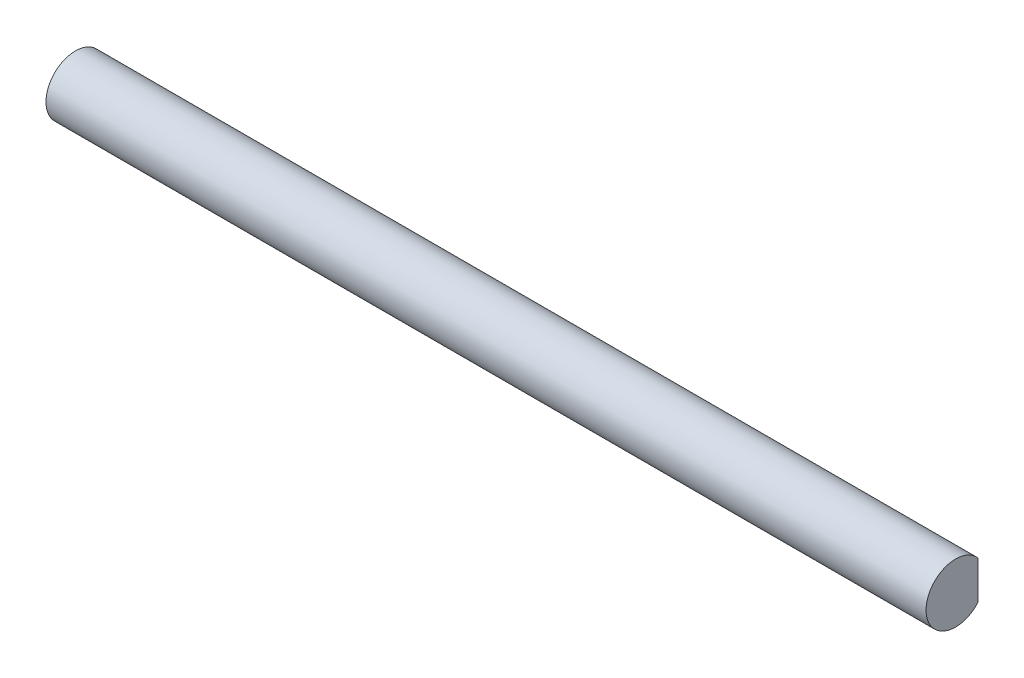
ISO-10303-21;
HEADER;
FILE_DESCRIPTION(('STEP AP214'),'2;1');
FILE_NAME('part.step','',(''),(''),'','','');
FILE_SCHEMA(('AUTOMOTIVE_DESIGN { 1 0 10303 214 1 1 1 1 }'));
ENDSEC;
DATA;
#1=APPLICATION_CONTEXT('core data for automotive mechanical design processes');
#2=APPLICATION_PROTOCOL_DEFINITION('international standard','automotive_design',2000,#1);
#3=PRODUCT_CONTEXT('',#1,'mechanical');
#4=PRODUCT('Part','Part','',(#3));
#5=PRODUCT_RELATED_PRODUCT_CATEGORY('part','',(#4));
#6=PRODUCT_DEFINITION_FORMATION('','',#4);
#7=PRODUCT_DEFINITION_CONTEXT('part definition',#1,'design');
#8=PRODUCT_DEFINITION('design','',#6,#7);
#9=PRODUCT_DEFINITION_SHAPE('','',#8);
#10=(LENGTH_UNIT() NAMED_UNIT(*) SI_UNIT(.MILLI.,.METRE.));
#11=(NAMED_UNIT(*) PLANE_ANGLE_UNIT() SI_UNIT($,.RADIAN.));
#12=(NAMED_UNIT(*) SI_UNIT($,.STERADIAN.) SOLID_ANGLE_UNIT());
#13=UNCERTAINTY_MEASURE_WITH_UNIT(LENGTH_MEASURE(1.E-05),#10,'distance_accuracy_value','');
#14=(GEOMETRIC_REPRESENTATION_CONTEXT(3) GLOBAL_UNCERTAINTY_ASSIGNED_CONTEXT((#13)) GLOBAL_UNIT_ASSIGNED_CONTEXT((#10,
#11,#12)) REPRESENTATION_CONTEXT('',''));
#15=CARTESIAN_POINT('',(0.,0.,0.));
#16=DIRECTION('',(0.,0.,1.));
#17=DIRECTION('',(1.,0.,0.));
#18=AXIS2_PLACEMENT_3D('',#15,#16,#17);
#19=CARTESIAN_POINT('',(85.,0.,0.));
#20=DIRECTION('',(-1.,0.,0.));
#21=DIRECTION('',(0.,0.,1.));
#22=AXIS2_PLACEMENT_3D('',#19,#20,#21);
#23=CYLINDRICAL_SURFACE('',#22,2.85);
#24=CARTESIAN_POINT('',(0.,0.,0.));
#25=DIRECTION('',(1.,0.,0.));
#26=DIRECTION('',(0.,0.,-1.));
#27=AXIS2_PLACEMENT_3D('',#24,#25,#26);
#28=CIRCLE('',#27,2.85);
#29=CARTESIAN_POINT('',(0.,1.85,-2.16794833886788));
#30=VERTEX_POINT('',#29);
#31=CARTESIAN_POINT('',(0.,-1.85,-2.16794833886788));
#32=VERTEX_POINT('',#31);
#33=EDGE_CURVE('E67',#30,#32,#28,.T.);
#34=ORIENTED_EDGE('',*,*,#33,.T.);
#35=DIRECTION('',(-1.,0.,0.));
#36=VECTOR('',#35,1.);
#37=CARTESIAN_POINT('',(85.,-1.85,-2.16794833886788));
#38=LINE('',#37,#36);
#39=CARTESIAN_POINT('',(85.,-1.85,-2.16794833886788));
#40=VERTEX_POINT('',#39);
#41=EDGE_CURVE('E11',#40,#32,#38,.T.);
#42=ORIENTED_EDGE('',*,*,#41,.F.);
#43=CARTESIAN_POINT('',(85.,0.,0.));
#44=DIRECTION('',(1.,0.,0.));
#45=DIRECTION('',(0.,0.,-1.));
#46=AXIS2_PLACEMENT_3D('',#43,#44,#45);
#47=CIRCLE('',#46,2.85);
#48=CARTESIAN_POINT('',(85.,1.85,-2.16794833886788));
#49=VERTEX_POINT('',#48);
#50=EDGE_CURVE('E66',#49,#40,#47,.T.);
#51=ORIENTED_EDGE('',*,*,#50,.F.);
#52=DIRECTION('',(-1.,0.,0.));
#53=VECTOR('',#52,1.);
#54=CARTESIAN_POINT('',(85.,1.85,-2.16794833886788));
#55=LINE('',#54,#53);
#56=EDGE_CURVE('E44',#49,#30,#55,.T.);
#57=ORIENTED_EDGE('',*,*,#56,.T.);
#58=EDGE_LOOP('',(#34,#42,#51,#57));
#59=FACE_BOUND('',#58,.T.);
#60=ADVANCED_FACE('F36',(#59),#23,.T.);
#61=CARTESIAN_POINT('',(85.,1.85,-2.16794833886788));
#62=DIRECTION('',(0.,0.,1.));
#63=DIRECTION('',(1.,0.,0.));
#64=AXIS2_PLACEMENT_3D('',#61,#62,#63);
#65=PLANE('',#64);
#66=DIRECTION('',(0.,1.,0.));
#67=VECTOR('',#66,1.);
#68=CARTESIAN_POINT('',(0.,1.85,-2.16794833886788));
#69=LINE('',#68,#67);
#70=EDGE_CURVE('E59',#32,#30,#69,.T.);
#71=ORIENTED_EDGE('',*,*,#70,.T.);
#72=ORIENTED_EDGE('',*,*,#56,.F.);
#73=DIRECTION('',(0.,1.,0.));
#74=VECTOR('',#73,1.);
#75=CARTESIAN_POINT('',(85.,1.85,-2.16794833886788));
#76=LINE('',#75,#74);
#77=EDGE_CURVE('E51',#40,#49,#76,.T.);
#78=ORIENTED_EDGE('',*,*,#77,.F.);
#79=ORIENTED_EDGE('',*,*,#41,.T.);
#80=EDGE_LOOP('',(#71,#72,#78,#79));
#81=FACE_BOUND('',#80,.T.);
#82=ADVANCED_FACE('F62',(#81),#65,.F.);
#83=CARTESIAN_POINT('',(85.,0.,0.));
#84=DIRECTION('',(1.,0.,0.));
#85=DIRECTION('',(0.,0.,-1.));
#86=AXIS2_PLACEMENT_3D('',#83,#84,#85);
#87=PLANE('',#86);
#88=ORIENTED_EDGE('',*,*,#50,.T.);
#89=ORIENTED_EDGE('',*,*,#77,.T.);
#90=EDGE_LOOP('',(#88,#89));
#91=FACE_BOUND('',#90,.T.);
#92=ADVANCED_FACE('F74',(#91),#87,.T.);
#93=CARTESIAN_POINT('',(0.,0.,0.));
#94=DIRECTION('',(1.,0.,0.));
#95=DIRECTION('',(0.,0.,-1.));
#96=AXIS2_PLACEMENT_3D('',#93,#94,#95);
#97=PLANE('',#96);
#98=ORIENTED_EDGE('',*,*,#33,.F.);
#99=ORIENTED_EDGE('',*,*,#70,.F.);
#100=EDGE_LOOP('',(#98,#99));
#101=FACE_BOUND('',#100,.T.);
#102=ADVANCED_FACE('F70',(#101),#97,.F.);
#103=CLOSED_SHELL('',(#60,#82,#92,#102));
#104=MANIFOLD_SOLID_BREP('B2',#103);
#105=ADVANCED_BREP_SHAPE_REPRESENTATION('',(#18,#104),#14);
#106=SHAPE_DEFINITION_REPRESENTATION(#9,#105);
ENDSEC;
END-ISO-10303-21;
